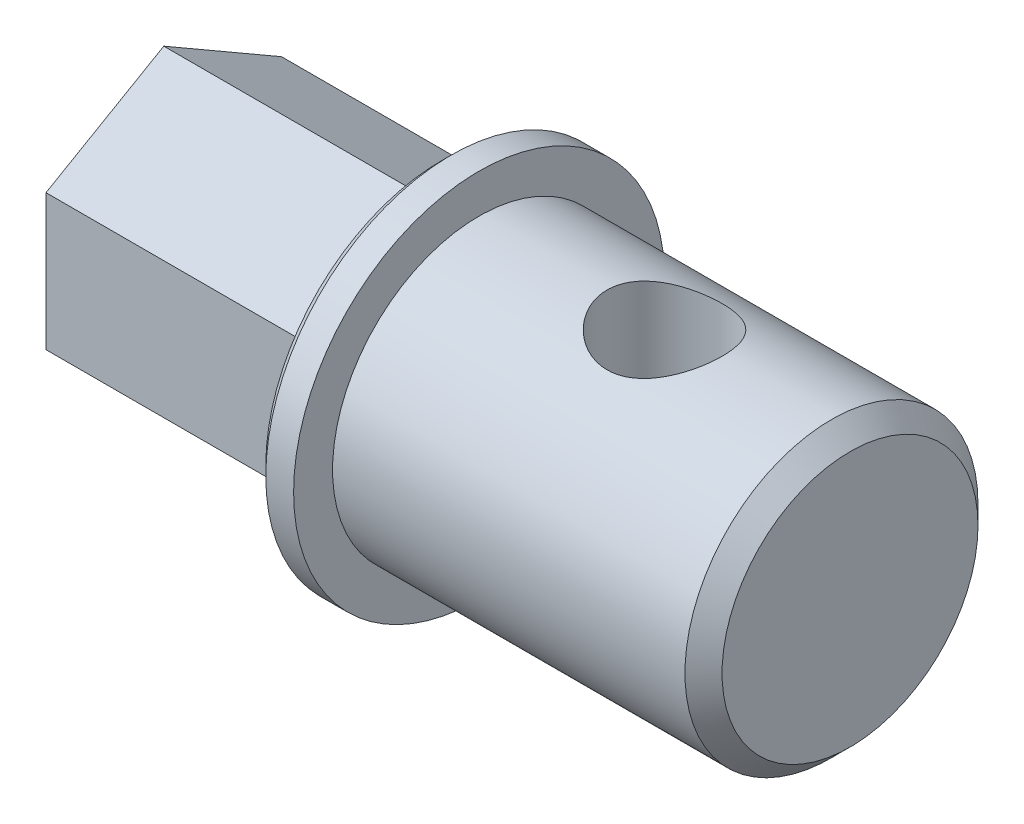
ISO-10303-21;
HEADER;
FILE_DESCRIPTION(('STEP AP214'),'2;1');
FILE_NAME('part.step','',(''),(''),'','','');
FILE_SCHEMA(('AUTOMOTIVE_DESIGN { 1 0 10303 214 1 1 1 1 }'));
ENDSEC;
DATA;
#1=APPLICATION_CONTEXT('core data for automotive mechanical design processes');
#2=APPLICATION_PROTOCOL_DEFINITION('international standard','automotive_design',2000,#1);
#3=PRODUCT_CONTEXT('',#1,'mechanical');
#4=PRODUCT('Part','Part','',(#3));
#5=PRODUCT_RELATED_PRODUCT_CATEGORY('part','',(#4));
#6=PRODUCT_DEFINITION_FORMATION('','',#4);
#7=PRODUCT_DEFINITION_CONTEXT('part definition',#1,'design');
#8=PRODUCT_DEFINITION('design','',#6,#7);
#9=PRODUCT_DEFINITION_SHAPE('','',#8);
#10=(LENGTH_UNIT() NAMED_UNIT(*) SI_UNIT(.MILLI.,.METRE.));
#11=(NAMED_UNIT(*) PLANE_ANGLE_UNIT() SI_UNIT($,.RADIAN.));
#12=(NAMED_UNIT(*) SI_UNIT($,.STERADIAN.) SOLID_ANGLE_UNIT());
#13=UNCERTAINTY_MEASURE_WITH_UNIT(LENGTH_MEASURE(1.E-05),#10,'distance_accuracy_value','');
#14=(GEOMETRIC_REPRESENTATION_CONTEXT(3) GLOBAL_UNCERTAINTY_ASSIGNED_CONTEXT((#13)) GLOBAL_UNIT_ASSIGNED_CONTEXT((#10,
#11,#12)) REPRESENTATION_CONTEXT('',''));
#15=CARTESIAN_POINT('',(0.,0.,0.));
#16=DIRECTION('',(0.,0.,1.));
#17=DIRECTION('',(1.,0.,0.));
#18=AXIS2_PLACEMENT_3D('',#15,#16,#17);
#19=CARTESIAN_POINT('',(20.,0.,0.));
#20=DIRECTION('',(-1.,0.,0.));
#21=DIRECTION('',(0.,0.,1.));
#22=AXIS2_PLACEMENT_3D('',#19,#20,#21);
#23=CYLINDRICAL_SURFACE('',#22,7.9);
#24=CARTESIAN_POINT('',(19.,0.,0.));
#25=DIRECTION('',(1.,0.,0.));
#26=DIRECTION('',(0.,0.,-1.));
#27=AXIS2_PLACEMENT_3D('',#24,#25,#26);
#28=CIRCLE('',#27,7.9);
#29=CARTESIAN_POINT('',(19.,0.,-7.9));
#30=VERTEX_POINT('',#29);
#31=EDGE_CURVE('E11',#30,#30,#28,.F.);
#32=ORIENTED_EDGE('',*,*,#31,.T.);
#33=EDGE_LOOP('',(#32));
#34=FACE_BOUND('',#33,.T.);
#35=CARTESIAN_POINT('',(10.,-7.26636084983398,3.1));
#36=CARTESIAN_POINT('',(10.1663346158653,-7.26636710949805,3.09999351847051));
#37=CARTESIAN_POINT('',(10.332955051347,-7.27215151188825,3.08653260810271));
#38=CARTESIAN_POINT('',(10.6614156667575,-7.29454929489087,3.03320818850061));
#39=CARTESIAN_POINT('',(10.8232421978606,-7.3111909710545,2.993275686265));
#40=CARTESIAN_POINT('',(11.136837463668,-7.35311644879813,2.88873826778125));
#41=CARTESIAN_POINT('',(11.288640815679,-7.37836842341094,2.82422411303483));
#42=CARTESIAN_POINT('',(11.5792296993829,-7.43462186683479,2.67262213711969));
#43=CARTESIAN_POINT('',(11.7180184258771,-7.46562191902808,2.58553987577835));
#44=CARTESIAN_POINT('',(11.9863577176001,-7.53178988522266,2.38614625265946));
#45=CARTESIAN_POINT('',(12.1151025114832,-7.56708854791225,2.27279336643924));
#46=CARTESIAN_POINT('',(12.3523408001219,-7.63679417086448,2.02627051594454));
#47=CARTESIAN_POINT('',(12.4608273547092,-7.67120082207378,1.8930937882975));
#48=CARTESIAN_POINT('',(12.6584190684678,-7.73680588764178,1.60452776876883));
#49=CARTESIAN_POINT('',(12.746638915474,-7.76783435643637,1.44849015051636));
#50=CARTESIAN_POINT('',(12.8952363077978,-7.82160938152175,1.12235484500192));
#51=CARTESIAN_POINT('',(12.9556247803773,-7.84435918747372,0.952262706866207));
#52=CARTESIAN_POINT('',(13.0439900088521,-7.8780889029301,0.611288894812916));
#53=CARTESIAN_POINT('',(13.0733510058438,-7.88956968563781,0.440816487760335));
#54=CARTESIAN_POINT('',(13.1032782997886,-7.90127416736964,0.097003592354353));
#55=CARTESIAN_POINT('',(13.1038549176573,-7.9015019012822,-0.0763358456964609));
#56=CARTESIAN_POINT('',(13.0769707233346,-7.89098374274002,-0.410982263764641));
#57=CARTESIAN_POINT('',(13.0510248395394,-7.88083077517019,-0.572432918358044));
#58=CARTESIAN_POINT('',(12.9744000798044,-7.85148454908576,-0.888475888709472));
#59=CARTESIAN_POINT('',(12.9237193950644,-7.83229062943026,-1.04306770199381));
#60=CARTESIAN_POINT('',(12.7984356728259,-7.78638595408502,-1.34376022091283));
#61=CARTESIAN_POINT('',(12.7234864867021,-7.75956716218171,-1.48969952838417));
#62=CARTESIAN_POINT('',(12.5521117557785,-7.70109054775387,-1.76730265121787));
#63=CARTESIAN_POINT('',(12.4556789739854,-7.66943109572801,-1.89896163381683));
#64=CARTESIAN_POINT('',(12.2369345031472,-7.60213011382686,-2.15313469104066));
#65=CARTESIAN_POINT('',(12.1133687799584,-7.56636337963099,-2.27453800786141));
#66=CARTESIAN_POINT('',(11.8474682063288,-7.4964461076441,-2.49534358123239));
#67=CARTESIAN_POINT('',(11.7051276940868,-7.4622960616265,-2.59473917672858));
#68=CARTESIAN_POINT('',(11.400934093372,-7.39864628524178,-2.77111583740955));
#69=CARTESIAN_POINT('',(11.2386662882743,-7.36929247480008,-2.84743866932457));
#70=CARTESIAN_POINT('',(10.9021231218695,-7.32026092803281,-2.97123993980027));
#71=CARTESIAN_POINT('',(10.7278552863409,-7.30057718904606,-3.01873627662334));
#72=CARTESIAN_POINT('',(10.3833103877494,-7.27455842500944,-3.08088870825382));
#73=CARTESIAN_POINT('',(10.2134097779068,-7.26750084415873,-3.09732569005301));
#74=CARTESIAN_POINT('',(9.87316855726062,-7.26547874677008,-3.10206978071329));
#75=CARTESIAN_POINT('',(9.70282808611748,-7.27051077392634,-3.09038492934167));
#76=CARTESIAN_POINT('',(9.37619241535563,-7.29136168311245,-3.0408365957478));
#77=CARTESIAN_POINT('',(9.2196352061247,-7.30658412661714,-3.00441907668649));
#78=CARTESIAN_POINT('',(8.91494687702002,-7.34537082896778,-2.9082973888063));
#79=CARTESIAN_POINT('',(8.7668175894863,-7.36893689384266,-2.84858817807036));
#80=CARTESIAN_POINT('',(8.47664372940254,-7.4229011344714,-2.70492734752464));
#81=CARTESIAN_POINT('',(8.33507352803402,-7.45353322003857,-2.62010812950565));
#82=CARTESIAN_POINT('',(8.06754885592117,-7.51781026296112,-2.42953287787291));
#83=CARTESIAN_POINT('',(7.94160058520701,-7.55145640747006,-2.32376857454229));
#84=CARTESIAN_POINT('',(7.69966093866379,-7.62083862099281,-2.08548659754756));
#85=CARTESIAN_POINT('',(7.58499967027525,-7.65655459372233,-1.95160756790945));
#86=CARTESIAN_POINT('',(7.37957891402032,-7.72380524707335,-1.66564707700384));
#87=CARTESIAN_POINT('',(7.28882009598321,-7.75533981050502,-1.51356510580068));
#88=CARTESIAN_POINT('',(7.1342062589481,-7.81073339597279,-1.19519200109596));
#89=CARTESIAN_POINT('',(7.07031544480831,-7.83460262013608,-1.02892012997483));
#90=CARTESIAN_POINT('',(6.97181459682315,-7.87196334688755,-0.686826238081698));
#91=CARTESIAN_POINT('',(6.93718933787567,-7.88546024523873,-0.511009233796531));
#92=CARTESIAN_POINT('',(6.89996032354475,-7.89999893201713,-0.166782109029406));
#93=CARTESIAN_POINT('',(6.8954732868068,-7.90177312742045,0.00139503627097473));
#94=CARTESIAN_POINT('',(6.91371471932851,-7.89462371314277,0.33601696631201));
#95=CARTESIAN_POINT('',(6.93643933294025,-7.88570161903031,0.502461993108063));
#96=CARTESIAN_POINT('',(7.00711865150312,-7.85851915942147,0.824011500662934));
#97=CARTESIAN_POINT('',(7.05433061774672,-7.84053412055966,0.979304350402065));
#98=CARTESIAN_POINT('',(7.17187728788584,-7.79713434870136,1.27974962339401));
#99=CARTESIAN_POINT('',(7.24221633143048,-7.77171822140757,1.42490013729913));
#100=CARTESIAN_POINT('',(7.40748802949084,-7.71458712095708,1.70789189369715));
#101=CARTESIAN_POINT('',(7.50335965698272,-7.68264574398631,1.84513809037886));
#102=CARTESIAN_POINT('',(7.71554859015978,-7.6163358678509,2.10215993043256));
#103=CARTESIAN_POINT('',(7.831873895833,-7.58196642216091,2.22192870424559));
#104=CARTESIAN_POINT('',(8.08979780802798,-7.5121619951126,2.44790370354027));
#105=CARTESIAN_POINT('',(8.23248343561413,-7.47678400107563,2.5528908434814));
#106=CARTESIAN_POINT('',(8.53459850477329,-7.41118964250036,2.7375005231295));
#107=CARTESIAN_POINT('',(8.69403018052225,-7.38097396810959,2.81711967263318));
#108=CARTESIAN_POINT('',(9.01088245776391,-7.33185112675661,2.94246477377473));
#109=CARTESIAN_POINT('',(9.16725518461086,-7.31218506218555,2.99054925616674));
#110=CARTESIAN_POINT('',(9.48626384723519,-7.28278017018195,3.06147434223789));
#111=CARTESIAN_POINT('',(9.64888076279454,-7.27301334718376,3.08438615105577));
#112=CARTESIAN_POINT('',(9.84343005691292,-7.26797919196603,3.09620318071312));
#113=CARTESIAN_POINT('',(9.87472061607179,-7.26737334317915,3.09762586595494));
#114=CARTESIAN_POINT('',(9.93733740063212,-7.26656356990444,3.09952491572971));
#115=CARTESIAN_POINT('',(9.96866362814162,-7.26635967055353,3.10000122107847));
#116=CARTESIAN_POINT('',(10.,-7.26636084983398,3.1));
#117=B_SPLINE_CURVE_WITH_KNOTS('',3,(#35,#36,#37,#38,#39,#40,#41,#42,#43,#44,#45,#46,#47,#48,
#49,#50,#51,#52,#53,#54,#55,#56,#57,#58,#59,#60,#61,#62,#63,#64,#65,#66,#67,#68,#69,#70,#71,#72,
#73,#74,#75,#76,#77,#78,#79,#80,#81,#82,#83,#84,#85,#86,#87,#88,#89,#90,#91,#92,#93,#94,#95,#96,
#97,#98,#99,#100,#101,#102,#103,#104,#105,#106,#107,#108,#109,#110,#111,#112,#113,#114,#115,
#116),.UNSPECIFIED.,.T.,.F.,(4,2,2,2,2,2,2,2,2,2,2,2,2,2,2,2,2,2,2,2,2,2,2,2,2,2,2,2,2,2,2,2,2,
2,2,2,2,2,2,2,4),(0.,0.498874424301249,0.999054205742628,1.49740482089948,1.99563278004856,
2.51870508656055,3.04195626233955,3.58494241162901,4.1277151895949,4.64509354386725,
5.16228638582811,5.65150295746495,6.14075530976998,6.63731841942563,7.13404905561471,
7.66230622600664,8.19072306554442,8.7330368891427,9.27501364673122,9.78484159993364,
10.2945238154401,10.7767158069103,11.2590122357218,11.7604380692871,12.2620622762048,
12.7990899242406,13.336132620046,13.8724575516268,14.4085032936735,14.9107131357066,
15.4128518275076,15.9005807086209,16.3884011612398,16.8975012425558,17.4068008914588,
17.94618562104,18.4856424043234,18.977830198215,19.4686221428478,19.5626009988923,
19.6565857319511),.UNSPECIFIED.);
#118=CARTESIAN_POINT('',(10.,-7.26636084983398,3.1));
#119=VERTEX_POINT('',#118);
#120=EDGE_CURVE('E114',#119,#119,#117,.T.);
#121=ORIENTED_EDGE('',*,*,#120,.T.);
#122=EDGE_LOOP('',(#121));
#123=FACE_BOUND('',#122,.T.);
#124=CARTESIAN_POINT('',(10.,7.26636084983398,3.1));
#125=CARTESIAN_POINT('',(9.83366538413467,7.26636710949805,3.09999351847051));
#126=CARTESIAN_POINT('',(9.66704494865304,7.27215151188824,3.08653260810271));
#127=CARTESIAN_POINT('',(9.33858433324254,7.29454929489087,3.03320818850061));
#128=CARTESIAN_POINT('',(9.17675780213939,7.3111909710545,2.993275686265));
#129=CARTESIAN_POINT('',(8.86316253633202,7.35311644879813,2.88873826778125));
#130=CARTESIAN_POINT('',(8.71135918432105,7.37836842341094,2.82422411303483));
#131=CARTESIAN_POINT('',(8.42077030061706,7.43462186683479,2.67262213711969));
#132=CARTESIAN_POINT('',(8.28198157412286,7.46562191902808,2.58553987577835));
#133=CARTESIAN_POINT('',(8.01364228239994,7.53178988522266,2.38614625265946));
#134=CARTESIAN_POINT('',(7.88489748851683,7.56708854791225,2.27279336643924));
#135=CARTESIAN_POINT('',(7.64765919987812,7.63679417086448,2.02627051594454));
#136=CARTESIAN_POINT('',(7.5391726452908,7.67120082207378,1.89309378829751));
#137=CARTESIAN_POINT('',(7.34158093153223,7.73680588764178,1.60452776876883));
#138=CARTESIAN_POINT('',(7.25336108452604,7.76783435643637,1.44849015051636));
#139=CARTESIAN_POINT('',(7.10476369220221,7.82160938152175,1.12235484500192));
#140=CARTESIAN_POINT('',(7.04437521962266,7.84435918747372,0.952262706866207));
#141=CARTESIAN_POINT('',(6.95600999114795,7.8780889029301,0.611288894812916));
#142=CARTESIAN_POINT('',(6.92664899415624,7.88956968563781,0.440816487760335));
#143=CARTESIAN_POINT('',(6.89672170021145,7.90127416736964,0.0970035923543531));
#144=CARTESIAN_POINT('',(6.89614508234274,7.9015019012822,-0.0763358456964607));
#145=CARTESIAN_POINT('',(6.92302927666537,7.89098374274002,-0.410982263764641));
#146=CARTESIAN_POINT('',(6.94897516046064,7.88083077517019,-0.572432918358044));
#147=CARTESIAN_POINT('',(7.02559992019559,7.85148454908576,-0.888475888709472));
#148=CARTESIAN_POINT('',(7.07628060493559,7.83229062943026,-1.04306770199381));
#149=CARTESIAN_POINT('',(7.20156432717407,7.78638595408502,-1.34376022091283));
#150=CARTESIAN_POINT('',(7.2765135132979,7.75956716218171,-1.48969952838417));
#151=CARTESIAN_POINT('',(7.44788824422155,7.70109054775387,-1.76730265121787));
#152=CARTESIAN_POINT('',(7.54432102601463,7.66943109572801,-1.89896163381684));
#153=CARTESIAN_POINT('',(7.76306549685278,7.60213011382686,-2.15313469104066));
#154=CARTESIAN_POINT('',(7.8866312200416,7.56636337963099,-2.27453800786141));
#155=CARTESIAN_POINT('',(8.1525317936712,7.49644610764409,-2.49534358123239));
#156=CARTESIAN_POINT('',(8.29487230591324,7.4622960616265,-2.59473917672858));
#157=CARTESIAN_POINT('',(8.59906590662803,7.39864628524178,-2.77111583740955));
#158=CARTESIAN_POINT('',(8.76133371172566,7.36929247480008,-2.84743866932457));
#159=CARTESIAN_POINT('',(9.09787687813051,7.32026092803281,-2.97123993980027));
#160=CARTESIAN_POINT('',(9.2721447136591,7.30057718904606,-3.01873627662334));
#161=CARTESIAN_POINT('',(9.61668961225058,7.27455842500945,-3.08088870825382));
#162=CARTESIAN_POINT('',(9.78659022209319,7.26750084415873,-3.09732569005301));
#163=CARTESIAN_POINT('',(10.1268314427394,7.26547874677008,-3.10206978071329));
#164=CARTESIAN_POINT('',(10.2971719138825,7.27051077392634,-3.09038492934168));
#165=CARTESIAN_POINT('',(10.6238075846444,7.29136168311245,-3.0408365957478));
#166=CARTESIAN_POINT('',(10.7803647938753,7.30658412661714,-3.00441907668649));
#167=CARTESIAN_POINT('',(11.08505312298,7.34537082896778,-2.9082973888063));
#168=CARTESIAN_POINT('',(11.2331824105137,7.36893689384266,-2.84858817807036));
#169=CARTESIAN_POINT('',(11.5233562705975,7.4229011344714,-2.70492734752464));
#170=CARTESIAN_POINT('',(11.664926471966,7.45353322003857,-2.62010812950565));
#171=CARTESIAN_POINT('',(11.9324511440788,7.51781026296112,-2.42953287787291));
#172=CARTESIAN_POINT('',(12.058399414793,7.55145640747006,-2.32376857454229));
#173=CARTESIAN_POINT('',(12.3003390613362,7.62083862099281,-2.08548659754756));
#174=CARTESIAN_POINT('',(12.4150003297248,7.65655459372233,-1.95160756790945));
#175=CARTESIAN_POINT('',(12.6204210859797,7.72380524707335,-1.66564707700384));
#176=CARTESIAN_POINT('',(12.7111799040168,7.75533981050502,-1.51356510580068));
#177=CARTESIAN_POINT('',(12.8657937410519,7.81073339597279,-1.19519200109596));
#178=CARTESIAN_POINT('',(12.9296845551917,7.83460262013608,-1.02892012997483));
#179=CARTESIAN_POINT('',(13.0281854031769,7.87196334688755,-0.686826238081699));
#180=CARTESIAN_POINT('',(13.0628106621243,7.88546024523873,-0.511009233796531));
#181=CARTESIAN_POINT('',(13.1000396764553,7.89999893201713,-0.166782109029406));
#182=CARTESIAN_POINT('',(13.1045267131932,7.90177312742045,0.00139503627097489));
#183=CARTESIAN_POINT('',(13.0862852806715,7.89462371314277,0.33601696631201));
#184=CARTESIAN_POINT('',(13.0635606670598,7.88570161903031,0.502461993108063));
#185=CARTESIAN_POINT('',(12.9928813484969,7.85851915942147,0.824011500662933));
#186=CARTESIAN_POINT('',(12.9456693822533,7.84053412055966,0.979304350402064));
#187=CARTESIAN_POINT('',(12.8281227121142,7.79713434870136,1.27974962339401));
#188=CARTESIAN_POINT('',(12.7577836685695,7.77171822140757,1.42490013729913));
#189=CARTESIAN_POINT('',(12.5925119705092,7.71458712095708,1.70789189369715));
#190=CARTESIAN_POINT('',(12.4966403430173,7.68264574398631,1.84513809037886));
#191=CARTESIAN_POINT('',(12.2844514098402,7.6163358678509,2.10215993043256));
#192=CARTESIAN_POINT('',(12.168126104167,7.58196642216091,2.22192870424559));
#193=CARTESIAN_POINT('',(11.910202191972,7.5121619951126,2.44790370354027));
#194=CARTESIAN_POINT('',(11.7675165643859,7.47678400107563,2.5528908434814));
#195=CARTESIAN_POINT('',(11.4654014952267,7.41118964250037,2.7375005231295));
#196=CARTESIAN_POINT('',(11.3059698194777,7.38097396810959,2.81711967263318));
#197=CARTESIAN_POINT('',(10.9891175422361,7.33185112675661,2.94246477377473));
#198=CARTESIAN_POINT('',(10.8327448153891,7.31218506218555,2.99054925616674));
#199=CARTESIAN_POINT('',(10.5137361527648,7.28278017018195,3.06147434223789));
#200=CARTESIAN_POINT('',(10.3511192372055,7.27301334718375,3.08438615105577));
#201=CARTESIAN_POINT('',(10.1565699430871,7.26797919196603,3.09620318071312));
#202=CARTESIAN_POINT('',(10.1252793839282,7.26737334317915,3.09762586595494));
#203=CARTESIAN_POINT('',(10.0626625993679,7.26656356990444,3.09952491572971));
#204=CARTESIAN_POINT('',(10.0313363718584,7.26635967055353,3.10000122107847));
#205=CARTESIAN_POINT('',(10.,7.26636084983398,3.1));
#206=B_SPLINE_CURVE_WITH_KNOTS('',3,(#124,#125,#126,#127,#128,#129,#130,#131,#132,#133,#134,
#135,#136,#137,#138,#139,#140,#141,#142,#143,#144,#145,#146,#147,#148,#149,#150,#151,#152,#153,
#154,#155,#156,#157,#158,#159,#160,#161,#162,#163,#164,#165,#166,#167,#168,#169,#170,#171,#172,
#173,#174,#175,#176,#177,#178,#179,#180,#181,#182,#183,#184,#185,#186,#187,#188,#189,#190,#191,
#192,#193,#194,#195,#196,#197,#198,#199,#200,#201,#202,#203,#204,#205),.UNSPECIFIED.,.T.,.F.,(4,
2,2,2,2,2,2,2,2,2,2,2,2,2,2,2,2,2,2,2,2,2,2,2,2,2,2,2,2,2,2,2,2,2,2,2,2,2,2,2,4),(0.,
0.498874424301249,0.999054205742628,1.49740482089948,1.99563278004856,2.51870508656055,
3.04195626233955,3.58494241162901,4.1277151895949,4.64509354386725,5.16228638582811,
5.65150295746495,6.14075530976998,6.63731841942563,7.13404905561471,7.66230622600664,
8.19072306554442,8.7330368891427,9.27501364673121,9.78484159993364,10.2945238154401,
10.7767158069103,11.2590122357218,11.7604380692871,12.2620622762048,12.7990899242406,
13.336132620046,13.8724575516268,14.4085032936735,14.9107131357066,15.4128518275076,
15.9005807086209,16.3884011612398,16.8975012425558,17.4068008914588,17.94618562104,
18.4856424043234,18.977830198215,19.4686221428478,19.5626009988923,19.6565857319511),.UNSPECIFIED.);
#207=CARTESIAN_POINT('',(10.,7.26636084983398,3.1));
#208=VERTEX_POINT('',#207);
#209=EDGE_CURVE('E171',#208,#208,#206,.T.);
#210=ORIENTED_EDGE('',*,*,#209,.T.);
#211=EDGE_LOOP('',(#210));
#212=FACE_BOUND('',#211,.T.);
#213=CARTESIAN_POINT('',(0.,0.,0.));
#214=DIRECTION('',(1.,0.,0.));
#215=DIRECTION('',(0.,0.,-1.));
#216=AXIS2_PLACEMENT_3D('',#213,#214,#215);
#217=CIRCLE('',#216,7.9);
#218=CARTESIAN_POINT('',(0.,0.,-7.9));
#219=VERTEX_POINT('',#218);
#220=EDGE_CURVE('E162',#219,#219,#217,.T.);
#221=ORIENTED_EDGE('',*,*,#220,.T.);
#222=EDGE_LOOP('',(#221));
#223=FACE_BOUND('',#222,.T.);
#224=ADVANCED_FACE('F46',(#34,#123,#212,#223),#23,.T.);
#225=CARTESIAN_POINT('',(20.,0.,0.));
#226=DIRECTION('',(1.,0.,0.));
#227=DIRECTION('',(0.,0.,-1.));
#228=AXIS2_PLACEMENT_3D('',#225,#226,#227);
#229=PLANE('',#228);
#230=CARTESIAN_POINT('',(20.,0.,0.));
#231=DIRECTION('',(1.,0.,0.));
#232=DIRECTION('',(0.,0.,-1.));
#233=AXIS2_PLACEMENT_3D('',#230,#231,#232);
#234=CIRCLE('',#233,6.89999999999999);
#235=CARTESIAN_POINT('',(20.,0.,-6.89999999999999));
#236=VERTEX_POINT('',#235);
#237=EDGE_CURVE('E55',#236,#236,#234,.T.);
#238=ORIENTED_EDGE('',*,*,#237,.T.);
#239=EDGE_LOOP('',(#238));
#240=FACE_BOUND('',#239,.T.);
#241=ADVANCED_FACE('F230',(#240),#229,.T.);
#242=CARTESIAN_POINT('',(-2.,0.,0.));
#243=DIRECTION('',(1.,0.,0.));
#244=DIRECTION('',(0.,0.,-1.));
#245=AXIS2_PLACEMENT_3D('',#242,#243,#244);
#246=CYLINDRICAL_SURFACE('',#245,10.);
#247=CARTESIAN_POINT('',(-1.49999999999999,0.,0.));
#248=DIRECTION('',(-1.,0.,0.));
#249=DIRECTION('',(0.,0.,1.));
#250=AXIS2_PLACEMENT_3D('',#247,#248,#249);
#251=CIRCLE('',#250,10.);
#252=CARTESIAN_POINT('',(-1.49999999999999,0.,10.));
#253=VERTEX_POINT('',#252);
#254=EDGE_CURVE('E168',#253,#253,#251,.F.);
#255=ORIENTED_EDGE('',*,*,#254,.T.);
#256=EDGE_LOOP('',(#255));
#257=FACE_BOUND('',#256,.T.);
#258=CARTESIAN_POINT('',(0.,0.,0.));
#259=DIRECTION('',(-1.,0.,0.));
#260=DIRECTION('',(0.,0.,1.));
#261=AXIS2_PLACEMENT_3D('',#258,#259,#260);
#262=CIRCLE('',#261,10.);
#263=CARTESIAN_POINT('',(0.,0.,10.));
#264=VERTEX_POINT('',#263);
#265=EDGE_CURVE('E159',#264,#264,#262,.T.);
#266=ORIENTED_EDGE('',*,*,#265,.T.);
#267=EDGE_LOOP('',(#266));
#268=FACE_BOUND('',#267,.T.);
#269=ADVANCED_FACE('F224',(#257,#268),#246,.T.);
#270=CARTESIAN_POINT('',(-2.,0.,0.));
#271=DIRECTION('',(-1.,0.,0.));
#272=DIRECTION('',(0.,0.,1.));
#273=AXIS2_PLACEMENT_3D('',#270,#271,#272);
#274=PLANE('',#273);
#275=CARTESIAN_POINT('',(-2.,0.,0.));
#276=DIRECTION('',(-1.,0.,0.));
#277=DIRECTION('',(0.,0.,1.));
#278=AXIS2_PLACEMENT_3D('',#275,#276,#277);
#279=CIRCLE('',#278,9.5);
#280=CARTESIAN_POINT('',(-2.,0.,9.5));
#281=VERTEX_POINT('',#280);
#282=EDGE_CURVE('E165',#281,#281,#279,.T.);
#283=ORIENTED_EDGE('',*,*,#282,.T.);
#284=EDGE_LOOP('',(#283));
#285=FACE_BOUND('',#284,.T.);
#286=DIRECTION('',(0.,1.,0.));
#287=VECTOR('',#286,1.);
#288=CARTESIAN_POINT('',(-2.,-3.6661742093541,6.35000000000002));
#289=LINE('',#288,#287);
#290=CARTESIAN_POINT('',(-2.,-3.6661742093541,6.35000000000002));
#291=VERTEX_POINT('',#290);
#292=CARTESIAN_POINT('',(-2.,3.66617420935415,6.34999999999999));
#293=VERTEX_POINT('',#292);
#294=EDGE_CURVE('E62',#291,#293,#289,.T.);
#295=ORIENTED_EDGE('',*,*,#294,.F.);
#296=DIRECTION('',(0.,0.500000000000004,0.866025403784436));
#297=VECTOR('',#296,1.);
#298=CARTESIAN_POINT('',(-2.,-7.33234841870825,0.));
#299=LINE('',#298,#297);
#300=CARTESIAN_POINT('',(-2.,-7.33234841870825,0.));
#301=VERTEX_POINT('',#300);
#302=EDGE_CURVE('E66',#301,#291,#299,.T.);
#303=ORIENTED_EDGE('',*,*,#302,.F.);
#304=DIRECTION('',(0.,-0.499999999999996,0.866025403784441));
#305=VECTOR('',#304,1.);
#306=CARTESIAN_POINT('',(-2.,-3.66617420935416,-6.34999999999998));
#307=LINE('',#306,#305);
#308=CARTESIAN_POINT('',(-2.,-3.66617420935416,-6.34999999999998));
#309=VERTEX_POINT('',#308);
#310=EDGE_CURVE('E139',#309,#301,#307,.T.);
#311=ORIENTED_EDGE('',*,*,#310,.F.);
#312=DIRECTION('',(0.,-1.,0.));
#313=VECTOR('',#312,1.);
#314=CARTESIAN_POINT('',(-2.,3.66617420935409,-6.35000000000002));
#315=LINE('',#314,#313);
#316=CARTESIAN_POINT('',(-2.,3.66617420935409,-6.35000000000002));
#317=VERTEX_POINT('',#316);
#318=EDGE_CURVE('E136',#317,#309,#315,.T.);
#319=ORIENTED_EDGE('',*,*,#318,.F.);
#320=DIRECTION('',(0.,-0.500000000000004,-0.866025403784436));
#321=VECTOR('',#320,1.);
#322=CARTESIAN_POINT('',(-2.,7.33234841870825,0.));
#323=LINE('',#322,#321);
#324=CARTESIAN_POINT('',(-2.,7.33234841870825,0.));
#325=VERTEX_POINT('',#324);
#326=EDGE_CURVE('E133',#325,#317,#323,.T.);
#327=ORIENTED_EDGE('',*,*,#326,.F.);
#328=DIRECTION('',(0.,0.499999999999997,-0.866025403784441));
#329=VECTOR('',#328,1.);
#330=CARTESIAN_POINT('',(-2.,3.66617420935415,6.34999999999999));
#331=LINE('',#330,#329);
#332=EDGE_CURVE('E111',#293,#325,#331,.T.);
#333=ORIENTED_EDGE('',*,*,#332,.F.);
#334=EDGE_LOOP('',(#295,#303,#311,#319,#327,#333));
#335=FACE_BOUND('',#334,.T.);
#336=ADVANCED_FACE('F221',(#285,#335),#274,.T.);
#337=CARTESIAN_POINT('',(0.,0.,0.));
#338=DIRECTION('',(-1.,0.,0.));
#339=DIRECTION('',(0.,0.,1.));
#340=AXIS2_PLACEMENT_3D('',#337,#338,#339);
#341=PLANE('',#340);
#342=ORIENTED_EDGE('',*,*,#220,.F.);
#343=EDGE_LOOP('',(#342));
#344=FACE_BOUND('',#343,.T.);
#345=ORIENTED_EDGE('',*,*,#265,.F.);
#346=EDGE_LOOP('',(#345));
#347=FACE_BOUND('',#346,.T.);
#348=ADVANCED_FACE('F219',(#344,#347),#341,.F.);
#349=CARTESIAN_POINT('',(-17.,-3.6661742093541,6.35000000000002));
#350=DIRECTION('',(0.,0.,-1.));
#351=DIRECTION('',(0.,1.,0.));
#352=AXIS2_PLACEMENT_3D('',#349,#350,#351);
#353=PLANE('',#352);
#354=ORIENTED_EDGE('',*,*,#294,.T.);
#355=DIRECTION('',(1.,0.,0.));
#356=VECTOR('',#355,1.);
#357=CARTESIAN_POINT('',(-17.,3.66617420935415,6.34999999999999));
#358=LINE('',#357,#356);
#359=CARTESIAN_POINT('',(-17.,3.66617420935415,6.34999999999999));
#360=VERTEX_POINT('',#359);
#361=EDGE_CURVE('E156',#360,#293,#358,.T.);
#362=ORIENTED_EDGE('',*,*,#361,.F.);
#363=DIRECTION('',(0.,1.,0.));
#364=VECTOR('',#363,1.);
#365=CARTESIAN_POINT('',(-17.,-3.6661742093541,6.35000000000002));
#366=LINE('',#365,#364);
#367=CARTESIAN_POINT('',(-17.,-3.6661742093541,6.35000000000002));
#368=VERTEX_POINT('',#367);
#369=EDGE_CURVE('E117',#368,#360,#366,.T.);
#370=ORIENTED_EDGE('',*,*,#369,.F.);
#371=DIRECTION('',(1.,0.,0.));
#372=VECTOR('',#371,1.);
#373=CARTESIAN_POINT('',(-17.,-3.6661742093541,6.35000000000002));
#374=LINE('',#373,#372);
#375=EDGE_CURVE('E129',#368,#291,#374,.T.);
#376=ORIENTED_EDGE('',*,*,#375,.T.);
#377=EDGE_LOOP('',(#354,#362,#370,#376));
#378=FACE_BOUND('',#377,.T.);
#379=ADVANCED_FACE('F215',(#378),#353,.F.);
#380=CARTESIAN_POINT('',(-17.,3.66617420935415,6.34999999999999));
#381=DIRECTION('',(0.,-0.866025403784441,-0.499999999999996));
#382=DIRECTION('',(0.,0.499999999999997,-0.866025403784441));
#383=AXIS2_PLACEMENT_3D('',#380,#381,#382);
#384=PLANE('',#383);
#385=ORIENTED_EDGE('',*,*,#332,.T.);
#386=DIRECTION('',(1.,0.,0.));
#387=VECTOR('',#386,1.);
#388=CARTESIAN_POINT('',(-17.,7.33234841870825,0.));
#389=LINE('',#388,#387);
#390=CARTESIAN_POINT('',(-17.,7.33234841870825,0.));
#391=VERTEX_POINT('',#390);
#392=EDGE_CURVE('E153',#391,#325,#389,.T.);
#393=ORIENTED_EDGE('',*,*,#392,.F.);
#394=DIRECTION('',(0.,0.499999999999997,-0.866025403784441));
#395=VECTOR('',#394,1.);
#396=CARTESIAN_POINT('',(-17.,3.66617420935415,6.34999999999999));
#397=LINE('',#396,#395);
#398=EDGE_CURVE('E120',#360,#391,#397,.T.);
#399=ORIENTED_EDGE('',*,*,#398,.F.);
#400=ORIENTED_EDGE('',*,*,#361,.T.);
#401=EDGE_LOOP('',(#385,#393,#399,#400));
#402=FACE_BOUND('',#401,.T.);
#403=ADVANCED_FACE('F211',(#402),#384,.F.);
#404=CARTESIAN_POINT('',(-17.,7.33234841870825,0.));
#405=DIRECTION('',(0.,-0.866025403784436,0.500000000000004));
#406=DIRECTION('',(0.,-0.500000000000005,-0.866025403784436));
#407=AXIS2_PLACEMENT_3D('',#404,#405,#406);
#408=PLANE('',#407);
#409=ORIENTED_EDGE('',*,*,#326,.T.);
#410=DIRECTION('',(1.,0.,0.));
#411=VECTOR('',#410,1.);
#412=CARTESIAN_POINT('',(-17.,3.66617420935409,-6.35000000000002));
#413=LINE('',#412,#411);
#414=CARTESIAN_POINT('',(-17.,3.66617420935409,-6.35000000000002));
#415=VERTEX_POINT('',#414);
#416=EDGE_CURVE('E150',#415,#317,#413,.T.);
#417=ORIENTED_EDGE('',*,*,#416,.F.);
#418=DIRECTION('',(0.,-0.500000000000004,-0.866025403784436));
#419=VECTOR('',#418,1.);
#420=CARTESIAN_POINT('',(-17.,7.33234841870825,0.));
#421=LINE('',#420,#419);
#422=EDGE_CURVE('E122',#391,#415,#421,.T.);
#423=ORIENTED_EDGE('',*,*,#422,.F.);
#424=ORIENTED_EDGE('',*,*,#392,.T.);
#425=EDGE_LOOP('',(#409,#417,#423,#424));
#426=FACE_BOUND('',#425,.T.);
#427=ADVANCED_FACE('F207',(#426),#408,.F.);
#428=CARTESIAN_POINT('',(-17.,3.66617420935409,-6.35000000000002));
#429=DIRECTION('',(0.,0.,1.));
#430=DIRECTION('',(0.,-1.,0.));
#431=AXIS2_PLACEMENT_3D('',#428,#429,#430);
#432=PLANE('',#431);
#433=ORIENTED_EDGE('',*,*,#318,.T.);
#434=DIRECTION('',(1.,0.,0.));
#435=VECTOR('',#434,1.);
#436=CARTESIAN_POINT('',(-17.,-3.66617420935416,-6.34999999999998));
#437=LINE('',#436,#435);
#438=CARTESIAN_POINT('',(-17.,-3.66617420935416,-6.34999999999998));
#439=VERTEX_POINT('',#438);
#440=EDGE_CURVE('E147',#439,#309,#437,.T.);
#441=ORIENTED_EDGE('',*,*,#440,.F.);
#442=DIRECTION('',(0.,-1.,0.));
#443=VECTOR('',#442,1.);
#444=CARTESIAN_POINT('',(-17.,3.66617420935409,-6.35000000000002));
#445=LINE('',#444,#443);
#446=EDGE_CURVE('E124',#415,#439,#445,.T.);
#447=ORIENTED_EDGE('',*,*,#446,.F.);
#448=ORIENTED_EDGE('',*,*,#416,.T.);
#449=EDGE_LOOP('',(#433,#441,#447,#448));
#450=FACE_BOUND('',#449,.T.);
#451=ADVANCED_FACE('F203',(#450),#432,.F.);
#452=CARTESIAN_POINT('',(-17.,-3.66617420935416,-6.34999999999998));
#453=DIRECTION('',(0.,0.866025403784441,0.499999999999996));
#454=DIRECTION('',(0.,-0.499999999999996,0.866025403784441));
#455=AXIS2_PLACEMENT_3D('',#452,#453,#454);
#456=PLANE('',#455);
#457=ORIENTED_EDGE('',*,*,#310,.T.);
#458=DIRECTION('',(1.,0.,0.));
#459=VECTOR('',#458,1.);
#460=CARTESIAN_POINT('',(-17.,-7.33234841870825,0.));
#461=LINE('',#460,#459);
#462=CARTESIAN_POINT('',(-17.,-7.33234841870825,0.));
#463=VERTEX_POINT('',#462);
#464=EDGE_CURVE('E144',#463,#301,#461,.T.);
#465=ORIENTED_EDGE('',*,*,#464,.F.);
#466=DIRECTION('',(0.,-0.499999999999996,0.866025403784441));
#467=VECTOR('',#466,1.);
#468=CARTESIAN_POINT('',(-17.,-3.66617420935416,-6.34999999999998));
#469=LINE('',#468,#467);
#470=EDGE_CURVE('E126',#439,#463,#469,.T.);
#471=ORIENTED_EDGE('',*,*,#470,.F.);
#472=ORIENTED_EDGE('',*,*,#440,.T.);
#473=EDGE_LOOP('',(#457,#465,#471,#472));
#474=FACE_BOUND('',#473,.T.);
#475=ADVANCED_FACE('F199',(#474),#456,.F.);
#476=CARTESIAN_POINT('',(-17.,-7.33234841870825,0.));
#477=DIRECTION('',(0.,0.866025403784436,-0.500000000000004));
#478=DIRECTION('',(0.,0.500000000000004,0.866025403784437));
#479=AXIS2_PLACEMENT_3D('',#476,#477,#478);
#480=PLANE('',#479);
#481=ORIENTED_EDGE('',*,*,#302,.T.);
#482=ORIENTED_EDGE('',*,*,#375,.F.);
#483=DIRECTION('',(0.,0.500000000000004,0.866025403784436));
#484=VECTOR('',#483,1.);
#485=CARTESIAN_POINT('',(-17.,-7.33234841870825,0.));
#486=LINE('',#485,#484);
#487=EDGE_CURVE('E128',#463,#368,#486,.T.);
#488=ORIENTED_EDGE('',*,*,#487,.F.);
#489=ORIENTED_EDGE('',*,*,#464,.T.);
#490=EDGE_LOOP('',(#481,#482,#488,#489));
#491=FACE_BOUND('',#490,.T.);
#492=ADVANCED_FACE('F195',(#491),#480,.F.);
#493=CARTESIAN_POINT('',(-17.,0.,0.));
#494=DIRECTION('',(-1.,0.,0.));
#495=DIRECTION('',(0.,0.,1.));
#496=AXIS2_PLACEMENT_3D('',#493,#494,#495);
#497=PLANE('',#496);
#498=CARTESIAN_POINT('',(-17.,0.,0.));
#499=DIRECTION('',(-1.,0.,0.));
#500=DIRECTION('',(0.,0.,1.));
#501=AXIS2_PLACEMENT_3D('',#498,#499,#500);
#502=CIRCLE('',#501,2.1);
#503=CARTESIAN_POINT('',(-17.,0.,2.1));
#504=VERTEX_POINT('',#503);
#505=EDGE_CURVE('E109',#504,#504,#502,.T.);
#506=ORIENTED_EDGE('',*,*,#505,.F.);
#507=EDGE_LOOP('',(#506));
#508=FACE_BOUND('',#507,.T.);
#509=ORIENTED_EDGE('',*,*,#369,.T.);
#510=ORIENTED_EDGE('',*,*,#398,.T.);
#511=ORIENTED_EDGE('',*,*,#422,.T.);
#512=ORIENTED_EDGE('',*,*,#446,.T.);
#513=ORIENTED_EDGE('',*,*,#470,.T.);
#514=ORIENTED_EDGE('',*,*,#487,.T.);
#515=EDGE_LOOP('',(#509,#510,#511,#512,#513,#514));
#516=FACE_BOUND('',#515,.T.);
#517=ADVANCED_FACE('F192',(#508,#516),#497,.T.);
#518=CARTESIAN_POINT('',(-2.,0.,0.));
#519=DIRECTION('',(1.,0.,0.));
#520=DIRECTION('',(0.,0.,-1.));
#521=AXIS2_PLACEMENT_3D('',#518,#519,#520);
#522=CONICAL_SURFACE('',#521,9.5,0.785398163397441);
#523=ORIENTED_EDGE('',*,*,#254,.F.);
#524=EDGE_LOOP('',(#523));
#525=FACE_BOUND('',#524,.T.);
#526=ORIENTED_EDGE('',*,*,#282,.F.);
#527=EDGE_LOOP('',(#526));
#528=FACE_BOUND('',#527,.T.);
#529=ADVANCED_FACE('F103',(#525,#528),#522,.T.);
#530=CARTESIAN_POINT('',(-4.6,0.,0.));
#531=DIRECTION('',(-1.,0.,0.));
#532=DIRECTION('',(0.,0.,1.));
#533=AXIS2_PLACEMENT_3D('',#530,#531,#532);
#534=CONICAL_SURFACE('',#533,2.1,1.02974425867665);
#535=CARTESIAN_POINT('',(-3.33819270004212,0.,0.));
#536=VERTEX_POINT('',#535);
#537=VERTEX_LOOP('',#536);
#538=FACE_BOUND('',#537,.T.);
#539=CARTESIAN_POINT('',(-4.6,0.,0.));
#540=DIRECTION('',(-1.,0.,0.));
#541=DIRECTION('',(0.,0.,1.));
#542=AXIS2_PLACEMENT_3D('',#539,#540,#541);
#543=CIRCLE('',#542,2.1);
#544=CARTESIAN_POINT('',(-4.6,0.,2.1));
#545=VERTEX_POINT('',#544);
#546=EDGE_CURVE('E107',#545,#545,#543,.T.);
#547=ORIENTED_EDGE('',*,*,#546,.T.);
#548=EDGE_LOOP('',(#547));
#549=FACE_BOUND('',#548,.T.);
#550=ADVANCED_FACE('F99',(#538,#549),#534,.F.);
#551=CARTESIAN_POINT('',(-17.,0.,0.));
#552=DIRECTION('',(-1.,0.,0.));
#553=DIRECTION('',(0.,0.,1.));
#554=AXIS2_PLACEMENT_3D('',#551,#552,#553);
#555=CYLINDRICAL_SURFACE('',#554,2.1);
#556=ORIENTED_EDGE('',*,*,#546,.F.);
#557=EDGE_LOOP('',(#556));
#558=FACE_BOUND('',#557,.T.);
#559=ORIENTED_EDGE('',*,*,#505,.T.);
#560=EDGE_LOOP('',(#559));
#561=FACE_BOUND('',#560,.T.);
#562=ADVANCED_FACE('F102',(#558,#561),#555,.F.);
#563=CARTESIAN_POINT('',(10.,-10.,0.));
#564=DIRECTION('',(0.,1.,0.));
#565=DIRECTION('',(0.,0.,1.));
#566=AXIS2_PLACEMENT_3D('',#563,#564,#565);
#567=CYLINDRICAL_SURFACE('',#566,3.1);
#568=ORIENTED_EDGE('',*,*,#209,.F.);
#569=EDGE_LOOP('',(#568));
#570=FACE_BOUND('',#569,.T.);
#571=ORIENTED_EDGE('',*,*,#120,.F.);
#572=EDGE_LOOP('',(#571));
#573=FACE_BOUND('',#572,.T.);
#574=ADVANCED_FACE('F184',(#570,#573),#567,.F.);
#575=CARTESIAN_POINT('',(20.,0.,0.));
#576=DIRECTION('',(-1.,0.,0.));
#577=DIRECTION('',(0.,0.,1.));
#578=AXIS2_PLACEMENT_3D('',#575,#576,#577);
#579=CONICAL_SURFACE('',#578,6.89999999999999,0.785398163397447);
#580=ORIENTED_EDGE('',*,*,#31,.F.);
#581=EDGE_LOOP('',(#580));
#582=FACE_BOUND('',#581,.T.);
#583=ORIENTED_EDGE('',*,*,#237,.F.);
#584=EDGE_LOOP('',(#583));
#585=FACE_BOUND('',#584,.T.);
#586=ADVANCED_FACE('F49',(#582,#585),#579,.T.);
#587=CLOSED_SHELL('',(#224,#241,#269,#336,#348,#379,#403,#427,#451,#475,#492,#517,#529,#550,
#562,#574,#586));
#588=MANIFOLD_SOLID_BREP('B2',#587);
#589=ADVANCED_BREP_SHAPE_REPRESENTATION('',(#18,#588),#14);
#590=SHAPE_DEFINITION_REPRESENTATION(#9,#589);
ENDSEC;
END-ISO-10303-21;
